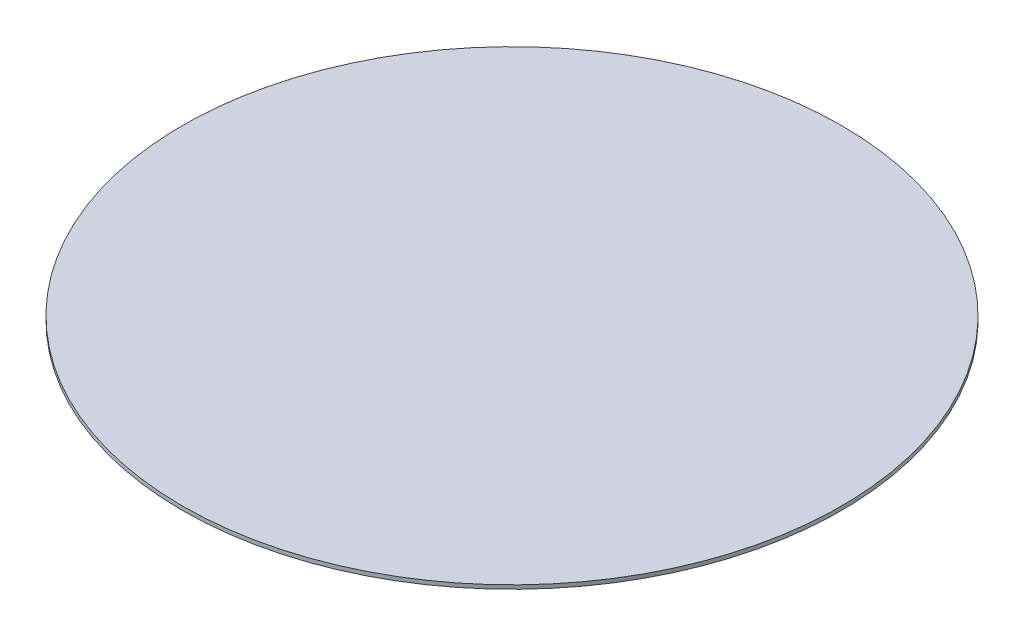
ISO-10303-21;
HEADER;
FILE_DESCRIPTION(('STEP AP214'),'2;1');
FILE_NAME('part.step','',(''),(''),'','','');
FILE_SCHEMA(('AUTOMOTIVE_DESIGN { 1 0 10303 214 1 1 1 1 }'));
ENDSEC;
DATA;
#1=APPLICATION_CONTEXT('core data for automotive mechanical design processes');
#2=APPLICATION_PROTOCOL_DEFINITION('international standard','automotive_design',2000,#1);
#3=PRODUCT_CONTEXT('',#1,'mechanical');
#4=PRODUCT('Part','Part','',(#3));
#5=PRODUCT_RELATED_PRODUCT_CATEGORY('part','',(#4));
#6=PRODUCT_DEFINITION_FORMATION('','',#4);
#7=PRODUCT_DEFINITION_CONTEXT('part definition',#1,'design');
#8=PRODUCT_DEFINITION('design','',#6,#7);
#9=PRODUCT_DEFINITION_SHAPE('','',#8);
#10=(LENGTH_UNIT() NAMED_UNIT(*) SI_UNIT(.MILLI.,.METRE.));
#11=(NAMED_UNIT(*) PLANE_ANGLE_UNIT() SI_UNIT($,.RADIAN.));
#12=(NAMED_UNIT(*) SI_UNIT($,.STERADIAN.) SOLID_ANGLE_UNIT());
#13=UNCERTAINTY_MEASURE_WITH_UNIT(LENGTH_MEASURE(1.E-05),#10,'distance_accuracy_value','');
#14=(GEOMETRIC_REPRESENTATION_CONTEXT(3) GLOBAL_UNCERTAINTY_ASSIGNED_CONTEXT((#13)) GLOBAL_UNIT_ASSIGNED_CONTEXT((#10,
#11,#12)) REPRESENTATION_CONTEXT('',''));
#15=CARTESIAN_POINT('',(0.,0.,0.));
#16=DIRECTION('',(0.,0.,1.));
#17=DIRECTION('',(1.,0.,0.));
#18=AXIS2_PLACEMENT_3D('',#15,#16,#17);
#19=CARTESIAN_POINT('',(0.,2.,0.));
#20=DIRECTION('',(0.,-1.,0.));
#21=DIRECTION('',(0.,0.,-1.));
#22=AXIS2_PLACEMENT_3D('',#19,#20,#21);
#23=CYLINDRICAL_SURFACE('',#22,84.9999999999999);
#24=CARTESIAN_POINT('',(0.,2.,0.));
#25=DIRECTION('',(0.,1.,0.));
#26=DIRECTION('',(0.,0.,1.));
#27=AXIS2_PLACEMENT_3D('',#24,#25,#26);
#28=CIRCLE('',#27,84.9999999999999);
#29=CARTESIAN_POINT('',(0.,2.,84.9999999999999));
#30=VERTEX_POINT('',#29);
#31=EDGE_CURVE('E10',#30,#30,#28,.T.);
#32=ORIENTED_EDGE('',*,*,#31,.F.);
#33=EDGE_LOOP('',(#32));
#34=FACE_BOUND('',#33,.T.);
#35=CARTESIAN_POINT('',(0.,1.,0.));
#36=DIRECTION('',(0.,1.,0.));
#37=DIRECTION('',(0.,0.,1.));
#38=AXIS2_PLACEMENT_3D('',#35,#36,#37);
#39=CIRCLE('',#38,84.9999999999999);
#40=CARTESIAN_POINT('',(0.,1.,84.9999999999999));
#41=VERTEX_POINT('',#40);
#42=EDGE_CURVE('E36',#41,#41,#39,.T.);
#43=ORIENTED_EDGE('',*,*,#42,.T.);
#44=EDGE_LOOP('',(#43));
#45=FACE_BOUND('',#44,.T.);
#46=ADVANCED_FACE('F33',(#34,#45),#23,.T.);
#47=CARTESIAN_POINT('',(0.,2.,0.));
#48=DIRECTION('',(0.,1.,0.));
#49=DIRECTION('',(0.,0.,1.));
#50=AXIS2_PLACEMENT_3D('',#47,#48,#49);
#51=PLANE('',#50);
#52=ORIENTED_EDGE('',*,*,#31,.T.);
#53=EDGE_LOOP('',(#52));
#54=FACE_BOUND('',#53,.T.);
#55=ADVANCED_FACE('F48',(#54),#51,.T.);
#56=CARTESIAN_POINT('',(0.,1.,0.));
#57=DIRECTION('',(0.,1.,0.));
#58=DIRECTION('',(0.,0.,1.));
#59=AXIS2_PLACEMENT_3D('',#56,#57,#58);
#60=PLANE('',#59);
#61=ORIENTED_EDGE('',*,*,#42,.F.);
#62=EDGE_LOOP('',(#61));
#63=FACE_BOUND('',#62,.T.);
#64=ADVANCED_FACE('F46',(#63),#60,.F.);
#65=CLOSED_SHELL('',(#46,#55,#64));
#66=MANIFOLD_SOLID_BREP('B2',#65);
#67=ADVANCED_BREP_SHAPE_REPRESENTATION('',(#18,#66),#14);
#68=SHAPE_DEFINITION_REPRESENTATION(#9,#67);
ENDSEC;
END-ISO-10303-21;
